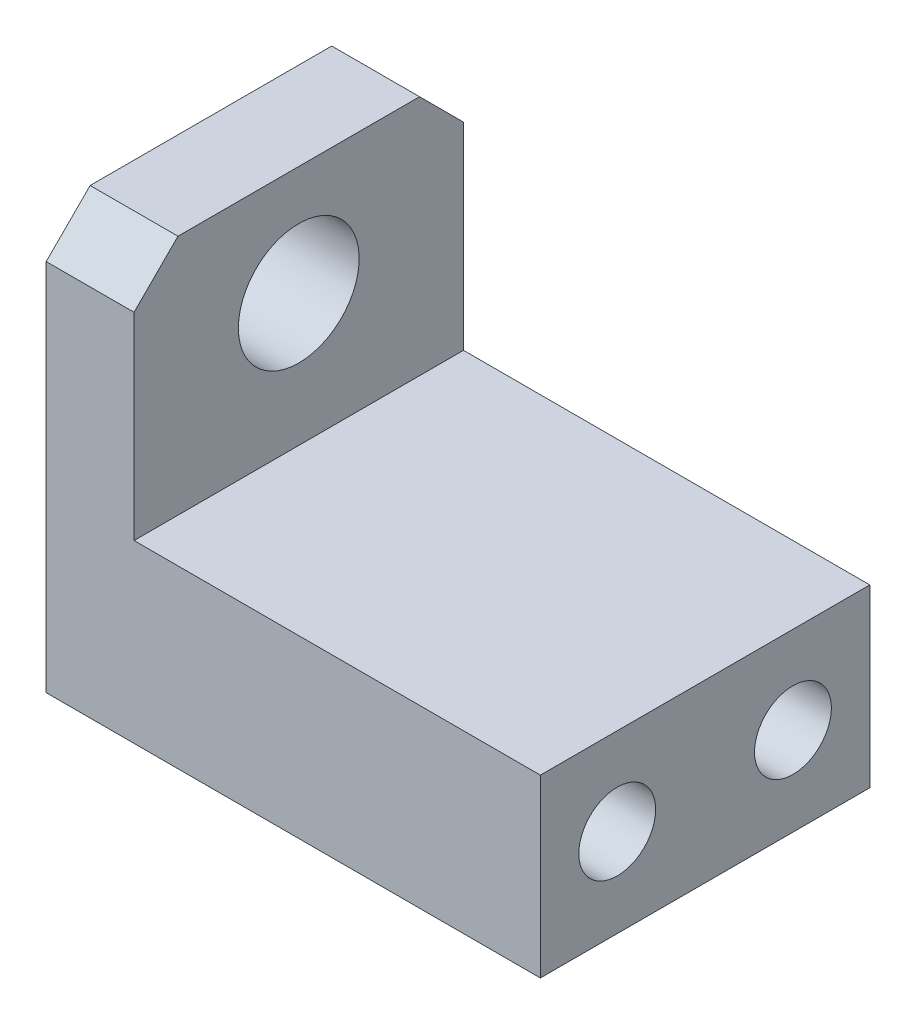
ISO-10303-21;
HEADER;
FILE_DESCRIPTION(('STEP AP214'),'2;1');
FILE_NAME('part.step','',(''),(''),'','','');
FILE_SCHEMA(('AUTOMOTIVE_DESIGN { 1 0 10303 214 1 1 1 1 }'));
ENDSEC;
DATA;
#1=APPLICATION_CONTEXT('core data for automotive mechanical design processes');
#2=APPLICATION_PROTOCOL_DEFINITION('international standard','automotive_design',2000,#1);
#3=PRODUCT_CONTEXT('',#1,'mechanical');
#4=PRODUCT('Part','Part','',(#3));
#5=PRODUCT_RELATED_PRODUCT_CATEGORY('part','',(#4));
#6=PRODUCT_DEFINITION_FORMATION('','',#4);
#7=PRODUCT_DEFINITION_CONTEXT('part definition',#1,'design');
#8=PRODUCT_DEFINITION('design','',#6,#7);
#9=PRODUCT_DEFINITION_SHAPE('','',#8);
#10=(LENGTH_UNIT() NAMED_UNIT(*) SI_UNIT(.MILLI.,.METRE.));
#11=(NAMED_UNIT(*) PLANE_ANGLE_UNIT() SI_UNIT($,.RADIAN.));
#12=(NAMED_UNIT(*) SI_UNIT($,.STERADIAN.) SOLID_ANGLE_UNIT());
#13=UNCERTAINTY_MEASURE_WITH_UNIT(LENGTH_MEASURE(1.E-05),#10,'distance_accuracy_value','');
#14=(GEOMETRIC_REPRESENTATION_CONTEXT(3) GLOBAL_UNCERTAINTY_ASSIGNED_CONTEXT((#13)) GLOBAL_UNIT_ASSIGNED_CONTEXT((#10,
#11,#12)) REPRESENTATION_CONTEXT('',''));
#15=CARTESIAN_POINT('',(0.,0.,0.));
#16=DIRECTION('',(0.,0.,1.));
#17=DIRECTION('',(1.,0.,0.));
#18=AXIS2_PLACEMENT_3D('',#15,#16,#17);
#19=CARTESIAN_POINT('',(-2.13533834586466,-16.9398496240602,15.));
#20=DIRECTION('',(1.,0.,0.));
#21=DIRECTION('',(0.,0.,-1.));
#22=AXIS2_PLACEMENT_3D('',#19,#20,#21);
#23=PLANE('',#22);
#24=CARTESIAN_POINT('',(-2.13533834586466,-12.9147060324,11.5));
#25=DIRECTION('',(-1.,0.,0.));
#26=DIRECTION('',(0.,0.,1.));
#27=AXIS2_PLACEMENT_3D('',#24,#25,#26);
#28=CIRCLE('',#27,3.);
#29=CARTESIAN_POINT('',(-2.13533834586466,-12.9147060324,14.5));
#30=VERTEX_POINT('',#29);
#31=EDGE_CURVE('E193',#30,#30,#28,.T.);
#32=ORIENTED_EDGE('',*,*,#31,.F.);
#33=EDGE_LOOP('',(#32));
#34=FACE_BOUND('',#33,.T.);
#35=CARTESIAN_POINT('',(-2.13533834586466,-12.9147060324,3.5));
#36=DIRECTION('',(-1.,0.,0.));
#37=DIRECTION('',(0.,0.,1.));
#38=AXIS2_PLACEMENT_3D('',#35,#36,#37);
#39=CIRCLE('',#38,3.);
#40=CARTESIAN_POINT('',(-2.13533834586466,-12.9147060324,6.5));
#41=VERTEX_POINT('',#40);
#42=EDGE_CURVE('E186',#41,#41,#39,.T.);
#43=ORIENTED_EDGE('',*,*,#42,.F.);
#44=EDGE_LOOP('',(#43));
#45=FACE_BOUND('',#44,.T.);
#46=CARTESIAN_POINT('',(-2.13533834586466,-2.93984962406015,7.5));
#47=DIRECTION('',(-1.,0.,0.));
#48=DIRECTION('',(0.,0.,1.));
#49=AXIS2_PLACEMENT_3D('',#46,#47,#48);
#50=CIRCLE('',#49,2.75);
#51=CARTESIAN_POINT('',(-2.13533834586466,-2.93984962406015,10.25));
#52=VERTEX_POINT('',#51);
#53=EDGE_CURVE('E132',#52,#52,#50,.T.);
#54=ORIENTED_EDGE('',*,*,#53,.F.);
#55=EDGE_LOOP('',(#54));
#56=FACE_BOUND('',#55,.T.);
#57=DIRECTION('',(0.,0.,-1.));
#58=VECTOR('',#57,1.);
#59=CARTESIAN_POINT('',(-2.13533834586466,2.06015037593985,15.));
#60=LINE('',#59,#58);
#61=CARTESIAN_POINT('',(-2.13533834586466,2.06015037593985,13.));
#62=VERTEX_POINT('',#61);
#63=CARTESIAN_POINT('',(-2.13533834586466,2.06015037593985,2.));
#64=VERTEX_POINT('',#63);
#65=EDGE_CURVE('E153',#62,#64,#60,.T.);
#66=ORIENTED_EDGE('',*,*,#65,.T.);
#67=DIRECTION('',(0.,-0.707106781186549,-0.707106781186546));
#68=VECTOR('',#67,1.);
#69=CARTESIAN_POINT('',(-2.13533834586466,2.06015037593985,2.));
#70=LINE('',#69,#68);
#71=CARTESIAN_POINT('',(-2.13533834586466,0.0601503759398367,0.));
#72=VERTEX_POINT('',#71);
#73=EDGE_CURVE('E138',#64,#72,#70,.T.);
#74=ORIENTED_EDGE('',*,*,#73,.T.);
#75=DIRECTION('',(0.,-1.,0.));
#76=VECTOR('',#75,1.);
#77=CARTESIAN_POINT('',(-2.13533834586466,-16.9398496240602,0.));
#78=LINE('',#77,#76);
#79=CARTESIAN_POINT('',(-2.13533834586466,-16.9398496240602,0.));
#80=VERTEX_POINT('',#79);
#81=EDGE_CURVE('E120',#72,#80,#78,.T.);
#82=ORIENTED_EDGE('',*,*,#81,.T.);
#83=DIRECTION('',(0.,0.,-1.));
#84=VECTOR('',#83,1.);
#85=CARTESIAN_POINT('',(-2.13533834586466,-16.9398496240602,15.));
#86=LINE('',#85,#84);
#87=CARTESIAN_POINT('',(-2.13533834586466,-16.9398496240602,15.));
#88=VERTEX_POINT('',#87);
#89=EDGE_CURVE('E113',#88,#80,#86,.T.);
#90=ORIENTED_EDGE('',*,*,#89,.F.);
#91=DIRECTION('',(0.,-1.,0.));
#92=VECTOR('',#91,1.);
#93=CARTESIAN_POINT('',(-2.13533834586466,-16.9398496240602,15.));
#94=LINE('',#93,#92);
#95=CARTESIAN_POINT('',(-2.13533834586466,0.0601503759398506,15.));
#96=VERTEX_POINT('',#95);
#97=EDGE_CURVE('E100',#96,#88,#94,.T.);
#98=ORIENTED_EDGE('',*,*,#97,.F.);
#99=DIRECTION('',(0.,-0.707106781186546,0.707106781186549));
#100=VECTOR('',#99,1.);
#101=CARTESIAN_POINT('',(-2.13533834586466,0.0601503759398488,15.));
#102=LINE('',#101,#100);
#103=EDGE_CURVE('E136',#96,#62,#102,.F.);
#104=ORIENTED_EDGE('',*,*,#103,.T.);
#105=EDGE_LOOP('',(#66,#74,#82,#90,#98,#104));
#106=FACE_BOUND('',#105,.T.);
#107=ADVANCED_FACE('F32',(#34,#45,#56,#106),#23,.F.);
#108=CARTESIAN_POINT('',(20.3646616541353,-16.9398496240601,15.));
#109=DIRECTION('',(0.,1.,0.));
#110=DIRECTION('',(-1.,0.,0.));
#111=AXIS2_PLACEMENT_3D('',#108,#109,#110);
#112=PLANE('',#111);
#113=DIRECTION('',(1.,0.,0.));
#114=VECTOR('',#113,1.);
#115=CARTESIAN_POINT('',(20.3646616541353,-16.9398496240601,0.));
#116=LINE('',#115,#114);
#117=CARTESIAN_POINT('',(20.3646616541353,-16.9398496240601,0.));
#118=VERTEX_POINT('',#117);
#119=EDGE_CURVE('E158',#80,#118,#116,.T.);
#120=ORIENTED_EDGE('',*,*,#119,.T.);
#121=DIRECTION('',(0.,0.,-1.));
#122=VECTOR('',#121,1.);
#123=CARTESIAN_POINT('',(20.3646616541353,-16.9398496240601,15.));
#124=LINE('',#123,#122);
#125=CARTESIAN_POINT('',(20.3646616541353,-16.9398496240601,15.));
#126=VERTEX_POINT('',#125);
#127=EDGE_CURVE('E115',#126,#118,#124,.T.);
#128=ORIENTED_EDGE('',*,*,#127,.F.);
#129=DIRECTION('',(1.,0.,0.));
#130=VECTOR('',#129,1.);
#131=CARTESIAN_POINT('',(20.3646616541353,-16.9398496240601,15.));
#132=LINE('',#131,#130);
#133=EDGE_CURVE('E103',#88,#126,#132,.T.);
#134=ORIENTED_EDGE('',*,*,#133,.F.);
#135=ORIENTED_EDGE('',*,*,#89,.T.);
#136=EDGE_LOOP('',(#120,#128,#134,#135));
#137=FACE_BOUND('',#136,.T.);
#138=ADVANCED_FACE('F112',(#137),#112,.F.);
#139=CARTESIAN_POINT('',(20.3646616541353,-8.93984962406015,15.));
#140=DIRECTION('',(-1.,0.,0.));
#141=DIRECTION('',(0.,0.,1.));
#142=AXIS2_PLACEMENT_3D('',#139,#140,#141);
#143=PLANE('',#142);
#144=CARTESIAN_POINT('',(20.3646616541353,-12.9147060324,11.5));
#145=DIRECTION('',(-1.,0.,0.));
#146=DIRECTION('',(0.,0.,1.));
#147=AXIS2_PLACEMENT_3D('',#144,#145,#146);
#148=CIRCLE('',#147,1.75);
#149=CARTESIAN_POINT('',(20.3646616541353,-12.9147060324,13.25));
#150=VERTEX_POINT('',#149);
#151=EDGE_CURVE('E206',#150,#150,#148,.T.);
#152=ORIENTED_EDGE('',*,*,#151,.T.);
#153=EDGE_LOOP('',(#152));
#154=FACE_BOUND('',#153,.T.);
#155=CARTESIAN_POINT('',(20.3646616541353,-12.9147060324,3.5));
#156=DIRECTION('',(-1.,0.,0.));
#157=DIRECTION('',(0.,0.,1.));
#158=AXIS2_PLACEMENT_3D('',#155,#156,#157);
#159=CIRCLE('',#158,1.75);
#160=CARTESIAN_POINT('',(20.3646616541353,-12.9147060324,5.25));
#161=VERTEX_POINT('',#160);
#162=EDGE_CURVE('E200',#161,#161,#159,.T.);
#163=ORIENTED_EDGE('',*,*,#162,.T.);
#164=EDGE_LOOP('',(#163));
#165=FACE_BOUND('',#164,.T.);
#166=DIRECTION('',(0.,1.,0.));
#167=VECTOR('',#166,1.);
#168=CARTESIAN_POINT('',(20.3646616541353,-8.93984962406015,0.));
#169=LINE('',#168,#167);
#170=CARTESIAN_POINT('',(20.3646616541353,-8.93984962406015,0.));
#171=VERTEX_POINT('',#170);
#172=EDGE_CURVE('E160',#118,#171,#169,.T.);
#173=ORIENTED_EDGE('',*,*,#172,.T.);
#174=DIRECTION('',(0.,0.,-1.));
#175=VECTOR('',#174,1.);
#176=CARTESIAN_POINT('',(20.3646616541353,-8.93984962406015,15.));
#177=LINE('',#176,#175);
#178=CARTESIAN_POINT('',(20.3646616541353,-8.93984962406015,15.));
#179=VERTEX_POINT('',#178);
#180=EDGE_CURVE('E126',#179,#171,#177,.T.);
#181=ORIENTED_EDGE('',*,*,#180,.F.);
#182=DIRECTION('',(0.,1.,0.));
#183=VECTOR('',#182,1.);
#184=CARTESIAN_POINT('',(20.3646616541353,-8.93984962406015,15.));
#185=LINE('',#184,#183);
#186=EDGE_CURVE('E117',#126,#179,#185,.T.);
#187=ORIENTED_EDGE('',*,*,#186,.F.);
#188=ORIENTED_EDGE('',*,*,#127,.T.);
#189=EDGE_LOOP('',(#173,#181,#187,#188));
#190=FACE_BOUND('',#189,.T.);
#191=ADVANCED_FACE('F180',(#154,#165,#190),#143,.F.);
#192=CARTESIAN_POINT('',(1.86466165413534,-8.93984962406015,15.));
#193=DIRECTION('',(0.,-1.,0.));
#194=DIRECTION('',(0.,0.,-1.));
#195=AXIS2_PLACEMENT_3D('',#192,#193,#194);
#196=PLANE('',#195);
#197=DIRECTION('',(-1.,0.,0.));
#198=VECTOR('',#197,1.);
#199=CARTESIAN_POINT('',(1.86466165413534,-8.93984962406015,0.));
#200=LINE('',#199,#198);
#201=CARTESIAN_POINT('',(1.86466165413534,-8.93984962406015,0.));
#202=VERTEX_POINT('',#201);
#203=EDGE_CURVE('E167',#171,#202,#200,.T.);
#204=ORIENTED_EDGE('',*,*,#203,.T.);
#205=DIRECTION('',(0.,0.,-1.));
#206=VECTOR('',#205,1.);
#207=CARTESIAN_POINT('',(1.86466165413534,-8.93984962406015,15.));
#208=LINE('',#207,#206);
#209=CARTESIAN_POINT('',(1.86466165413534,-8.93984962406015,15.));
#210=VERTEX_POINT('',#209);
#211=EDGE_CURVE('E152',#210,#202,#208,.T.);
#212=ORIENTED_EDGE('',*,*,#211,.F.);
#213=DIRECTION('',(-1.,0.,0.));
#214=VECTOR('',#213,1.);
#215=CARTESIAN_POINT('',(1.86466165413534,-8.93984962406015,15.));
#216=LINE('',#215,#214);
#217=EDGE_CURVE('E178',#179,#210,#216,.T.);
#218=ORIENTED_EDGE('',*,*,#217,.F.);
#219=ORIENTED_EDGE('',*,*,#180,.T.);
#220=EDGE_LOOP('',(#204,#212,#218,#219));
#221=FACE_BOUND('',#220,.T.);
#222=ADVANCED_FACE('F176',(#221),#196,.F.);
#223=CARTESIAN_POINT('',(1.86466165413534,2.06015037593985,15.));
#224=DIRECTION('',(-1.,0.,0.));
#225=DIRECTION('',(0.,-1.,0.));
#226=AXIS2_PLACEMENT_3D('',#223,#224,#225);
#227=PLANE('',#226);
#228=CARTESIAN_POINT('',(1.86466165413534,-2.93984962406015,7.5));
#229=DIRECTION('',(-1.,0.,0.));
#230=DIRECTION('',(0.,-1.,0.));
#231=AXIS2_PLACEMENT_3D('',#228,#229,#230);
#232=CIRCLE('',#231,2.75);
#233=CARTESIAN_POINT('',(1.86466165413534,-5.68984962406015,7.5));
#234=VERTEX_POINT('',#233);
#235=EDGE_CURVE('E130',#234,#234,#232,.T.);
#236=ORIENTED_EDGE('',*,*,#235,.T.);
#237=EDGE_LOOP('',(#236));
#238=FACE_BOUND('',#237,.T.);
#239=DIRECTION('',(0.,1.,0.));
#240=VECTOR('',#239,1.);
#241=CARTESIAN_POINT('',(1.86466165413534,2.06015037593985,0.));
#242=LINE('',#241,#240);
#243=CARTESIAN_POINT('',(1.86466165413534,0.0601503759398384,0.));
#244=VERTEX_POINT('',#243);
#245=EDGE_CURVE('E108',#202,#244,#242,.T.);
#246=ORIENTED_EDGE('',*,*,#245,.T.);
#247=DIRECTION('',(0.,0.707106781186549,0.707106781186546));
#248=VECTOR('',#247,1.);
#249=CARTESIAN_POINT('',(1.86466165413534,2.06015037593985,2.));
#250=LINE('',#249,#248);
#251=CARTESIAN_POINT('',(1.86466165413534,2.06015037593985,2.));
#252=VERTEX_POINT('',#251);
#253=EDGE_CURVE('E40',#244,#252,#250,.T.);
#254=ORIENTED_EDGE('',*,*,#253,.T.);
#255=DIRECTION('',(0.,0.,-1.));
#256=VECTOR('',#255,1.);
#257=CARTESIAN_POINT('',(1.86466165413534,2.06015037593985,15.));
#258=LINE('',#257,#256);
#259=CARTESIAN_POINT('',(1.86466165413534,2.06015037593985,13.));
#260=VERTEX_POINT('',#259);
#261=EDGE_CURVE('E144',#260,#252,#258,.T.);
#262=ORIENTED_EDGE('',*,*,#261,.F.);
#263=DIRECTION('',(0.,0.707106781186546,-0.707106781186549));
#264=VECTOR('',#263,1.);
#265=CARTESIAN_POINT('',(1.86466165413534,0.060150375939849,15.));
#266=LINE('',#265,#264);
#267=CARTESIAN_POINT('',(1.86466165413534,0.0601503759398488,15.));
#268=VERTEX_POINT('',#267);
#269=EDGE_CURVE('E47',#260,#268,#266,.F.);
#270=ORIENTED_EDGE('',*,*,#269,.T.);
#271=DIRECTION('',(0.,1.,0.));
#272=VECTOR('',#271,1.);
#273=CARTESIAN_POINT('',(1.86466165413534,2.06015037593985,15.));
#274=LINE('',#273,#272);
#275=EDGE_CURVE('E163',#210,#268,#274,.T.);
#276=ORIENTED_EDGE('',*,*,#275,.F.);
#277=ORIENTED_EDGE('',*,*,#211,.T.);
#278=EDGE_LOOP('',(#246,#254,#262,#270,#276,#277));
#279=FACE_BOUND('',#278,.T.);
#280=ADVANCED_FACE('F143',(#238,#279),#227,.F.);
#281=CARTESIAN_POINT('',(-2.13533834586466,2.06015037593985,15.));
#282=DIRECTION('',(0.,-1.,0.));
#283=DIRECTION('',(0.,0.,-1.));
#284=AXIS2_PLACEMENT_3D('',#281,#282,#283);
#285=PLANE('',#284);
#286=ORIENTED_EDGE('',*,*,#261,.T.);
#287=DIRECTION('',(-1.,0.,0.));
#288=VECTOR('',#287,1.);
#289=CARTESIAN_POINT('',(-2.13533834586466,2.06015037593985,2.));
#290=LINE('',#289,#288);
#291=EDGE_CURVE('E124',#252,#64,#290,.T.);
#292=ORIENTED_EDGE('',*,*,#291,.T.);
#293=ORIENTED_EDGE('',*,*,#65,.F.);
#294=DIRECTION('',(1.,0.,0.));
#295=VECTOR('',#294,1.);
#296=CARTESIAN_POINT('',(-2.13533834586466,2.06015037593985,13.));
#297=LINE('',#296,#295);
#298=EDGE_CURVE('E122',#62,#260,#297,.T.);
#299=ORIENTED_EDGE('',*,*,#298,.T.);
#300=EDGE_LOOP('',(#286,#292,#293,#299));
#301=FACE_BOUND('',#300,.T.);
#302=ADVANCED_FACE('F149',(#301),#285,.F.);
#303=CARTESIAN_POINT('',(0.,0.,15.));
#304=DIRECTION('',(0.,0.,-1.));
#305=DIRECTION('',(-1.,0.,0.));
#306=AXIS2_PLACEMENT_3D('',#303,#304,#305);
#307=PLANE('',#306);
#308=ORIENTED_EDGE('',*,*,#275,.T.);
#309=DIRECTION('',(-1.,0.,0.));
#310=VECTOR('',#309,1.);
#311=CARTESIAN_POINT('',(0.,0.0601503759398488,15.));
#312=LINE('',#311,#310);
#313=EDGE_CURVE('E11',#268,#96,#312,.T.);
#314=ORIENTED_EDGE('',*,*,#313,.T.);
#315=ORIENTED_EDGE('',*,*,#97,.T.);
#316=ORIENTED_EDGE('',*,*,#133,.T.);
#317=ORIENTED_EDGE('',*,*,#186,.T.);
#318=ORIENTED_EDGE('',*,*,#217,.T.);
#319=EDGE_LOOP('',(#308,#314,#315,#316,#317,#318));
#320=FACE_BOUND('',#319,.T.);
#321=ADVANCED_FACE('F102',(#320),#307,.F.);
#322=CARTESIAN_POINT('',(0.,0.,0.));
#323=DIRECTION('',(0.,0.,-1.));
#324=DIRECTION('',(-1.,0.,0.));
#325=AXIS2_PLACEMENT_3D('',#322,#323,#324);
#326=PLANE('',#325);
#327=ORIENTED_EDGE('',*,*,#81,.F.);
#328=DIRECTION('',(1.,0.,0.));
#329=VECTOR('',#328,1.);
#330=CARTESIAN_POINT('',(1.86466165413534,0.0601503759398384,0.));
#331=LINE('',#330,#329);
#332=EDGE_CURVE('E55',#72,#244,#331,.T.);
#333=ORIENTED_EDGE('',*,*,#332,.T.);
#334=ORIENTED_EDGE('',*,*,#245,.F.);
#335=ORIENTED_EDGE('',*,*,#203,.F.);
#336=ORIENTED_EDGE('',*,*,#172,.F.);
#337=ORIENTED_EDGE('',*,*,#119,.F.);
#338=EDGE_LOOP('',(#327,#333,#334,#335,#336,#337));
#339=FACE_BOUND('',#338,.T.);
#340=ADVANCED_FACE('F156',(#339),#326,.T.);
#341=CARTESIAN_POINT('',(12.8646616541353,-2.93984962406015,7.5));
#342=DIRECTION('',(-1.,0.,0.));
#343=DIRECTION('',(0.,0.,1.));
#344=AXIS2_PLACEMENT_3D('',#341,#342,#343);
#345=CYLINDRICAL_SURFACE('',#344,2.75);
#346=ORIENTED_EDGE('',*,*,#53,.T.);
#347=EDGE_LOOP('',(#346));
#348=FACE_BOUND('',#347,.T.);
#349=ORIENTED_EDGE('',*,*,#235,.F.);
#350=EDGE_LOOP('',(#349));
#351=FACE_BOUND('',#350,.T.);
#352=ADVANCED_FACE('F245',(#348,#351),#345,.F.);
#353=CARTESIAN_POINT('',(12.8646616541353,-12.9147060324,3.5));
#354=DIRECTION('',(-1.,0.,0.));
#355=DIRECTION('',(0.,0.,1.));
#356=AXIS2_PLACEMENT_3D('',#353,#354,#355);
#357=CYLINDRICAL_SURFACE('',#356,3.);
#358=CARTESIAN_POINT('',(12.8646616541353,-12.9147060324,3.5));
#359=DIRECTION('',(-1.,0.,0.));
#360=DIRECTION('',(0.,0.,1.));
#361=AXIS2_PLACEMENT_3D('',#358,#359,#360);
#362=CIRCLE('',#361,3.);
#363=CARTESIAN_POINT('',(12.8646616541353,-12.9147060324,6.5));
#364=VERTEX_POINT('',#363);
#365=EDGE_CURVE('E189',#364,#364,#362,.T.);
#366=ORIENTED_EDGE('',*,*,#365,.F.);
#367=EDGE_LOOP('',(#366));
#368=FACE_BOUND('',#367,.T.);
#369=ORIENTED_EDGE('',*,*,#42,.T.);
#370=EDGE_LOOP('',(#369));
#371=FACE_BOUND('',#370,.T.);
#372=ADVANCED_FACE('F250',(#368,#371),#357,.F.);
#373=CARTESIAN_POINT('',(12.8646616541353,-12.9147060324,3.5));
#374=DIRECTION('',(-1.,0.,0.));
#375=DIRECTION('',(0.,0.,1.));
#376=AXIS2_PLACEMENT_3D('',#373,#374,#375);
#377=PLANE('',#376);
#378=CARTESIAN_POINT('',(12.8646616541353,-12.9147060324,3.5));
#379=DIRECTION('',(-1.,0.,0.));
#380=DIRECTION('',(0.,0.,1.));
#381=AXIS2_PLACEMENT_3D('',#378,#379,#380);
#382=CIRCLE('',#381,1.75);
#383=CARTESIAN_POINT('',(12.8646616541353,-12.9147060324,5.25));
#384=VERTEX_POINT('',#383);
#385=EDGE_CURVE('E190',#384,#384,#382,.T.);
#386=ORIENTED_EDGE('',*,*,#385,.F.);
#387=EDGE_LOOP('',(#386));
#388=FACE_BOUND('',#387,.T.);
#389=ORIENTED_EDGE('',*,*,#365,.T.);
#390=EDGE_LOOP('',(#389));
#391=FACE_BOUND('',#390,.T.);
#392=ADVANCED_FACE('F254',(#388,#391),#377,.T.);
#393=CARTESIAN_POINT('',(12.8646616541353,-12.9147060324,11.5));
#394=DIRECTION('',(-1.,0.,0.));
#395=DIRECTION('',(0.,0.,1.));
#396=AXIS2_PLACEMENT_3D('',#393,#394,#395);
#397=CYLINDRICAL_SURFACE('',#396,3.);
#398=CARTESIAN_POINT('',(12.8646616541353,-12.9147060324,11.5));
#399=DIRECTION('',(-1.,0.,0.));
#400=DIRECTION('',(0.,0.,1.));
#401=AXIS2_PLACEMENT_3D('',#398,#399,#400);
#402=CIRCLE('',#401,3.);
#403=CARTESIAN_POINT('',(12.8646616541353,-12.9147060324,14.5));
#404=VERTEX_POINT('',#403);
#405=EDGE_CURVE('E185',#404,#404,#402,.T.);
#406=ORIENTED_EDGE('',*,*,#405,.F.);
#407=EDGE_LOOP('',(#406));
#408=FACE_BOUND('',#407,.T.);
#409=ORIENTED_EDGE('',*,*,#31,.T.);
#410=EDGE_LOOP('',(#409));
#411=FACE_BOUND('',#410,.T.);
#412=ADVANCED_FACE('F258',(#408,#411),#397,.F.);
#413=CARTESIAN_POINT('',(12.8646616541353,-12.9147060324,11.5));
#414=DIRECTION('',(-1.,0.,0.));
#415=DIRECTION('',(0.,0.,1.));
#416=AXIS2_PLACEMENT_3D('',#413,#414,#415);
#417=PLANE('',#416);
#418=CARTESIAN_POINT('',(12.8646616541353,-12.9147060324,11.5));
#419=DIRECTION('',(-1.,0.,0.));
#420=DIRECTION('',(0.,0.,1.));
#421=AXIS2_PLACEMENT_3D('',#418,#419,#420);
#422=CIRCLE('',#421,1.75);
#423=CARTESIAN_POINT('',(12.8646616541353,-12.9147060324,13.25));
#424=VERTEX_POINT('',#423);
#425=EDGE_CURVE('E203',#424,#424,#422,.T.);
#426=ORIENTED_EDGE('',*,*,#425,.F.);
#427=EDGE_LOOP('',(#426));
#428=FACE_BOUND('',#427,.T.);
#429=ORIENTED_EDGE('',*,*,#405,.T.);
#430=EDGE_LOOP('',(#429));
#431=FACE_BOUND('',#430,.T.);
#432=ADVANCED_FACE('F221',(#428,#431),#417,.T.);
#433=CARTESIAN_POINT('',(20.3646616541353,-12.9147060324,3.5));
#434=DIRECTION('',(-1.,0.,0.));
#435=DIRECTION('',(0.,0.,1.));
#436=AXIS2_PLACEMENT_3D('',#433,#434,#435);
#437=CYLINDRICAL_SURFACE('',#436,1.75);
#438=ORIENTED_EDGE('',*,*,#385,.T.);
#439=EDGE_LOOP('',(#438));
#440=FACE_BOUND('',#439,.T.);
#441=ORIENTED_EDGE('',*,*,#162,.F.);
#442=EDGE_LOOP('',(#441));
#443=FACE_BOUND('',#442,.T.);
#444=ADVANCED_FACE('F214',(#440,#443),#437,.F.);
#445=CARTESIAN_POINT('',(20.3646616541353,-12.9147060324,11.5));
#446=DIRECTION('',(-1.,0.,0.));
#447=DIRECTION('',(0.,0.,1.));
#448=AXIS2_PLACEMENT_3D('',#445,#446,#447);
#449=CYLINDRICAL_SURFACE('',#448,1.75);
#450=ORIENTED_EDGE('',*,*,#425,.T.);
#451=EDGE_LOOP('',(#450));
#452=FACE_BOUND('',#451,.T.);
#453=ORIENTED_EDGE('',*,*,#151,.F.);
#454=EDGE_LOOP('',(#453));
#455=FACE_BOUND('',#454,.T.);
#456=ADVANCED_FACE('F212',(#452,#455),#449,.F.);
#457=CARTESIAN_POINT('',(-2.13533834586466,2.06015037593985,2.));
#458=DIRECTION('',(0.,0.707106781186546,-0.707106781186549));
#459=DIRECTION('',(1.,0.,0.));
#460=AXIS2_PLACEMENT_3D('',#457,#458,#459);
#461=PLANE('',#460);
#462=ORIENTED_EDGE('',*,*,#253,.F.);
#463=ORIENTED_EDGE('',*,*,#332,.F.);
#464=ORIENTED_EDGE('',*,*,#73,.F.);
#465=ORIENTED_EDGE('',*,*,#291,.F.);
#466=EDGE_LOOP('',(#462,#463,#464,#465));
#467=FACE_BOUND('',#466,.T.);
#468=ADVANCED_FACE('F155',(#467),#461,.T.);
#469=CARTESIAN_POINT('',(0.,0.0601503759398488,15.));
#470=DIRECTION('',(0.,-0.707106781186549,-0.707106781186546));
#471=DIRECTION('',(-1.,0.,0.));
#472=AXIS2_PLACEMENT_3D('',#469,#470,#471);
#473=PLANE('',#472);
#474=ORIENTED_EDGE('',*,*,#269,.F.);
#475=ORIENTED_EDGE('',*,*,#298,.F.);
#476=ORIENTED_EDGE('',*,*,#103,.F.);
#477=ORIENTED_EDGE('',*,*,#313,.F.);
#478=EDGE_LOOP('',(#474,#475,#476,#477));
#479=FACE_BOUND('',#478,.T.);
#480=ADVANCED_FACE('F34',(#479),#473,.F.);
#481=CLOSED_SHELL('',(#107,#138,#191,#222,#280,#302,#321,#340,#352,#372,#392,#412,#432,#444,
#456,#468,#480));
#482=MANIFOLD_SOLID_BREP('B2',#481);
#483=ADVANCED_BREP_SHAPE_REPRESENTATION('',(#18,#482),#14);
#484=SHAPE_DEFINITION_REPRESENTATION(#9,#483);
ENDSEC;
END-ISO-10303-21;
